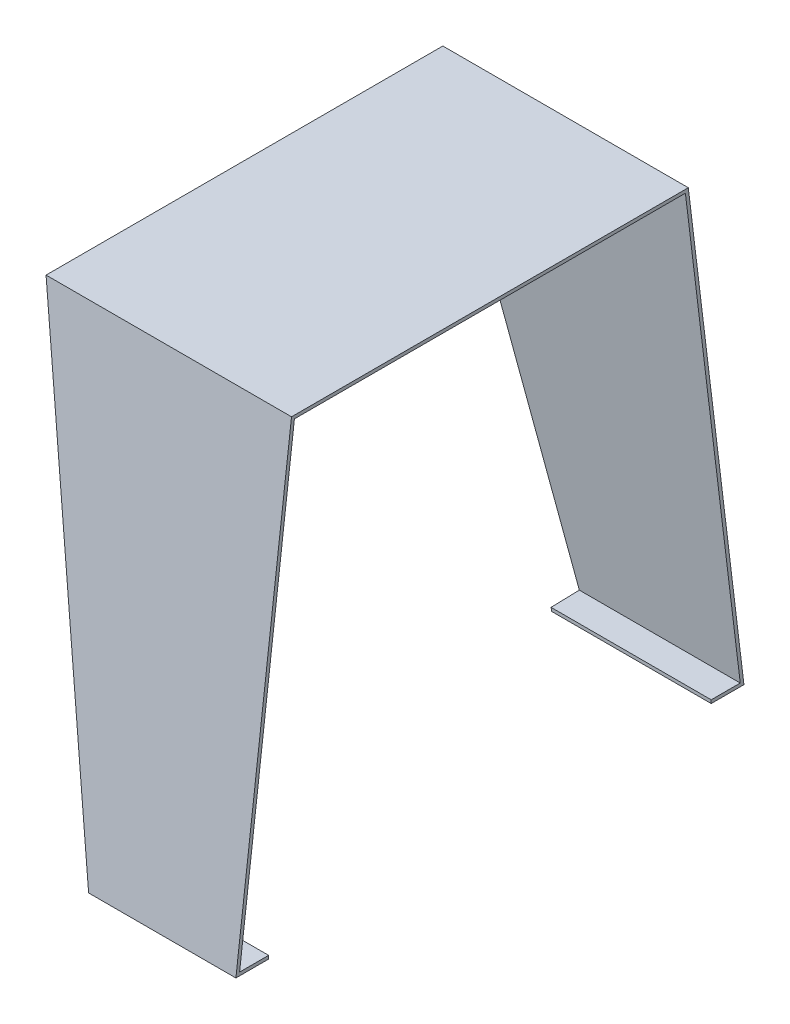
ISO-10303-21;
HEADER;
FILE_DESCRIPTION(('STEP AP214'),'2;1');
FILE_NAME('part.step','',(''),(''),'','','');
FILE_SCHEMA(('AUTOMOTIVE_DESIGN { 1 0 10303 214 1 1 1 1 }'));
ENDSEC;
DATA;
#1=APPLICATION_CONTEXT('core data for automotive mechanical design processes');
#2=APPLICATION_PROTOCOL_DEFINITION('international standard','automotive_design',2000,#1);
#3=PRODUCT_CONTEXT('',#1,'mechanical');
#4=PRODUCT('Part','Part','',(#3));
#5=PRODUCT_RELATED_PRODUCT_CATEGORY('part','',(#4));
#6=PRODUCT_DEFINITION_FORMATION('','',#4);
#7=PRODUCT_DEFINITION_CONTEXT('part definition',#1,'design');
#8=PRODUCT_DEFINITION('design','',#6,#7);
#9=PRODUCT_DEFINITION_SHAPE('','',#8);
#10=(LENGTH_UNIT() NAMED_UNIT(*) SI_UNIT(.MILLI.,.METRE.));
#11=(NAMED_UNIT(*) PLANE_ANGLE_UNIT() SI_UNIT($,.RADIAN.));
#12=(NAMED_UNIT(*) SI_UNIT($,.STERADIAN.) SOLID_ANGLE_UNIT());
#13=UNCERTAINTY_MEASURE_WITH_UNIT(LENGTH_MEASURE(1.E-05),#10,'distance_accuracy_value','');
#14=(GEOMETRIC_REPRESENTATION_CONTEXT(3) GLOBAL_UNCERTAINTY_ASSIGNED_CONTEXT((#13)) GLOBAL_UNIT_ASSIGNED_CONTEXT((#10,
#11,#12)) REPRESENTATION_CONTEXT('',''));
#15=CARTESIAN_POINT('',(0.,0.,0.));
#16=DIRECTION('',(0.,0.,1.));
#17=DIRECTION('',(1.,0.,0.));
#18=AXIS2_PLACEMENT_3D('',#15,#16,#17);
#19=CARTESIAN_POINT('',(150.,-280.,34.));
#20=DIRECTION('',(0.,1.,0.));
#21=DIRECTION('',(0.,0.,1.));
#22=AXIS2_PLACEMENT_3D('',#19,#20,#21);
#23=PLANE('',#22);
#24=DIRECTION('',(0.,0.,-1.));
#25=VECTOR('',#24,1.);
#26=CARTESIAN_POINT('',(150.,-280.,34.));
#27=LINE('',#26,#25);
#28=CARTESIAN_POINT('',(150.,-280.,-256.46));
#29=VERTEX_POINT('',#28);
#30=CARTESIAN_POINT('',(150.,-280.,-276.46));
#31=VERTEX_POINT('',#30);
#32=EDGE_CURVE('E183',#29,#31,#27,.T.);
#33=ORIENTED_EDGE('',*,*,#32,.F.);
#34=DIRECTION('',(1.,0.,0.));
#35=VECTOR('',#34,1.);
#36=CARTESIAN_POINT('',(0.,-280.,-256.46));
#37=LINE('',#36,#35);
#38=CARTESIAN_POINT('',(52.5519332294233,-280.,-256.46));
#39=VERTEX_POINT('',#38);
#40=EDGE_CURVE('E136',#39,#29,#37,.T.);
#41=ORIENTED_EDGE('',*,*,#40,.F.);
#42=DIRECTION('',(-0.0256338887285018,0.,-0.999671397884652));
#43=VECTOR('',#42,1.);
#44=CARTESIAN_POINT('',(60.0591386626211,-280.,36.3062918840597));
#45=LINE('',#44,#43);
#46=CARTESIAN_POINT('',(52.0390869324753,-280.,-276.46));
#47=VERTEX_POINT('',#46);
#48=EDGE_CURVE('E230',#39,#47,#45,.T.);
#49=ORIENTED_EDGE('',*,*,#48,.T.);
#50=DIRECTION('',(-1.,0.,0.));
#51=VECTOR('',#50,1.);
#52=CARTESIAN_POINT('',(150.,-280.,-276.46));
#53=LINE('',#52,#51);
#54=EDGE_CURVE('E193',#31,#47,#53,.T.);
#55=ORIENTED_EDGE('',*,*,#54,.F.);
#56=EDGE_LOOP('',(#33,#41,#49,#55));
#57=FACE_BOUND('',#56,.T.);
#58=ADVANCED_FACE('F32',(#57),#23,.F.);
#59=CARTESIAN_POINT('',(150.,-278.,31.742451915128));
#60=DIRECTION('',(0.,1.,0.));
#61=DIRECTION('',(0.,0.,1.));
#62=AXIS2_PLACEMENT_3D('',#59,#60,#61);
#63=PLANE('',#62);
#64=DIRECTION('',(-1.,0.,0.));
#65=VECTOR('',#64,1.);
#66=CARTESIAN_POINT('',(0.,-278.,-256.46));
#67=LINE('',#66,#65);
#68=CARTESIAN_POINT('',(150.,-278.,-256.46));
#69=VERTEX_POINT('',#68);
#70=CARTESIAN_POINT('',(52.129589220172,-278.,-256.46));
#71=VERTEX_POINT('',#70);
#72=EDGE_CURVE('E55',#69,#71,#67,.T.);
#73=ORIENTED_EDGE('',*,*,#72,.F.);
#74=DIRECTION('',(0.,0.,-1.));
#75=VECTOR('',#74,1.);
#76=CARTESIAN_POINT('',(150.,-278.,31.742451915128));
#77=LINE('',#76,#75);
#78=CARTESIAN_POINT('',(150.,-278.,-274.202451915128));
#79=VERTEX_POINT('',#78);
#80=EDGE_CURVE('E154',#69,#79,#77,.T.);
#81=ORIENTED_EDGE('',*,*,#80,.T.);
#82=DIRECTION('',(-1.,0.,0.));
#83=VECTOR('',#82,1.);
#84=CARTESIAN_POINT('',(150.,-278.,-274.202451915128));
#85=LINE('',#84,#83);
#86=CARTESIAN_POINT('',(51.6746316819994,-278.,-274.202451915128));
#87=VERTEX_POINT('',#86);
#88=EDGE_CURVE('E153',#79,#87,#85,.T.);
#89=ORIENTED_EDGE('',*,*,#88,.T.);
#90=DIRECTION('',(-0.0256338887285018,0.,-0.999671397884652));
#91=VECTOR('',#90,1.);
#92=CARTESIAN_POINT('',(59.5792214537459,-278.,34.0610499873584));
#93=LINE('',#92,#91);
#94=EDGE_CURVE('E40',#71,#87,#93,.T.);
#95=ORIENTED_EDGE('',*,*,#94,.F.);
#96=EDGE_LOOP('',(#73,#81,#89,#95));
#97=FACE_BOUND('',#96,.T.);
#98=ADVANCED_FACE('F220',(#97),#63,.T.);
#99=CARTESIAN_POINT('',(60.,-317.150927648449,-271.948815928403));
#100=DIRECTION('',(0.978114448495998,0.206550388842234,-0.0250811186451284));
#101=DIRECTION('',(-0.206615386062609,0.97842224128553,0.));
#102=AXIS2_PLACEMENT_3D('',#99,#100,#101);
#103=PLANE('',#102);
#104=ORIENTED_EDGE('',*,*,#48,.F.);
#105=DIRECTION('',(0.206615386062609,-0.97842224128553,0.));
#106=VECTOR('',#105,1.);
#107=CARTESIAN_POINT('',(50.3086976789349,-269.377211461033,-256.46));
#108=LINE('',#107,#106);
#109=EDGE_CURVE('E210',#71,#39,#108,.T.);
#110=ORIENTED_EDGE('',*,*,#109,.F.);
#111=ORIENTED_EDGE('',*,*,#94,.T.);
#112=DIRECTION('',(-0.20227182697728,0.972188237006813,0.118051428779399));
#113=VECTOR('',#112,1.);
#114=CARTESIAN_POINT('',(55.6975051811138,-297.335318977688,-276.550312076704));
#115=LINE('',#114,#113);
#116=CARTESIAN_POINT('',(0.,-29.6338789062195,-244.043708639455));
#117=VERTEX_POINT('',#116);
#118=EDGE_CURVE('E208',#87,#117,#115,.T.);
#119=ORIENTED_EDGE('',*,*,#118,.T.);
#120=DIRECTION('',(0.,0.120543125395831,0.99270809149508));
#121=VECTOR('',#120,1.);
#122=CARTESIAN_POINT('',(0.,-37.1509276484489,-305.948815928403));
#123=LINE('',#122,#121);
#124=CARTESIAN_POINT('',(0.,-29.8821811402827,-246.088550567034));
#125=VERTEX_POINT('',#124);
#126=EDGE_CURVE('E236',#125,#117,#123,.T.);
#127=ORIENTED_EDGE('',*,*,#126,.F.);
#128=DIRECTION('',(-0.20227182697728,0.972188237006813,0.118051428779398));
#129=VECTOR('',#128,1.);
#130=CARTESIAN_POINT('',(56.047049148837,-299.263650204496,-278.799157524832));
#131=LINE('',#130,#129);
#132=EDGE_CURVE('E217',#47,#125,#131,.T.);
#133=ORIENTED_EDGE('',*,*,#132,.F.);
#134=EDGE_LOOP('',(#104,#110,#111,#119,#127,#133));
#135=FACE_BOUND('',#134,.T.);
#136=ADVANCED_FACE('F207',(#135),#103,.F.);
#137=CARTESIAN_POINT('',(150.,0.,0.));
#138=DIRECTION('',(1.,0.,0.));
#139=DIRECTION('',(0.,0.,-1.));
#140=AXIS2_PLACEMENT_3D('',#137,#138,#139);
#141=PLANE('',#140);
#142=DIRECTION('',(0.,1.,0.));
#143=VECTOR('',#142,1.);
#144=CARTESIAN_POINT('',(150.,-280.001,-256.46));
#145=LINE('',#144,#143);
#146=EDGE_CURVE('E147',#29,#69,#145,.T.);
#147=ORIENTED_EDGE('',*,*,#146,.F.);
#148=ORIENTED_EDGE('',*,*,#32,.T.);
#149=DIRECTION('',(0.,0.992708091495081,0.120543125395831));
#150=VECTOR('',#149,1.);
#151=CARTESIAN_POINT('',(150.,-280.,-276.46));
#152=LINE('',#151,#150);
#153=CARTESIAN_POINT('',(150.,0.,-242.46));
#154=VERTEX_POINT('',#153);
#155=EDGE_CURVE('E185',#31,#154,#152,.T.);
#156=ORIENTED_EDGE('',*,*,#155,.T.);
#157=DIRECTION('',(0.,0.,1.));
#158=VECTOR('',#157,1.);
#159=CARTESIAN_POINT('',(150.,0.,-242.46));
#160=LINE('',#159,#158);
#161=CARTESIAN_POINT('',(150.,0.,0.));
#162=VERTEX_POINT('',#161);
#163=EDGE_CURVE('E177',#154,#162,#160,.T.);
#164=ORIENTED_EDGE('',*,*,#163,.T.);
#165=DIRECTION('',(0.,-0.99270809149508,0.120543125395831));
#166=VECTOR('',#165,1.);
#167=CARTESIAN_POINT('',(150.,0.,0.));
#168=LINE('',#167,#166);
#169=CARTESIAN_POINT('',(150.,-280.,34.));
#170=VERTEX_POINT('',#169);
#171=EDGE_CURVE('E180',#162,#170,#168,.T.);
#172=ORIENTED_EDGE('',*,*,#171,.T.);
#173=CARTESIAN_POINT('',(150.,-280.,14.));
#174=VERTEX_POINT('',#173);
#175=EDGE_CURVE('E146',#170,#174,#27,.T.);
#176=ORIENTED_EDGE('',*,*,#175,.T.);
#177=DIRECTION('',(0.,1.,0.));
#178=VECTOR('',#177,1.);
#179=CARTESIAN_POINT('',(150.,-280.001,14.));
#180=LINE('',#179,#178);
#181=CARTESIAN_POINT('',(150.,-278.,14.));
#182=VERTEX_POINT('',#181);
#183=EDGE_CURVE('E131',#174,#182,#180,.T.);
#184=ORIENTED_EDGE('',*,*,#183,.T.);
#185=CARTESIAN_POINT('',(150.,-278.,31.742451915128));
#186=VERTEX_POINT('',#185);
#187=EDGE_CURVE('E144',#186,#182,#77,.T.);
#188=ORIENTED_EDGE('',*,*,#187,.F.);
#189=DIRECTION('',(0.,-0.99270809149508,0.120543125395831));
#190=VECTOR('',#189,1.);
#191=CARTESIAN_POINT('',(150.,-2.,-1.77183379915767));
#192=LINE('',#191,#190);
#193=CARTESIAN_POINT('',(150.,-2.,-1.77183379915767));
#194=VERTEX_POINT('',#193);
#195=EDGE_CURVE('E158',#194,#186,#192,.T.);
#196=ORIENTED_EDGE('',*,*,#195,.F.);
#197=DIRECTION('',(0.,0.,1.));
#198=VECTOR('',#197,1.);
#199=CARTESIAN_POINT('',(150.,-2.,-240.688166200842));
#200=LINE('',#199,#198);
#201=CARTESIAN_POINT('',(150.,-2.,-240.688166200842));
#202=VERTEX_POINT('',#201);
#203=EDGE_CURVE('E224',#202,#194,#200,.T.);
#204=ORIENTED_EDGE('',*,*,#203,.F.);
#205=DIRECTION('',(0.,0.99270809149508,0.120543125395831));
#206=VECTOR('',#205,1.);
#207=CARTESIAN_POINT('',(150.,-278.,-274.202451915128));
#208=LINE('',#207,#206);
#209=EDGE_CURVE('E167',#79,#202,#208,.T.);
#210=ORIENTED_EDGE('',*,*,#209,.F.);
#211=ORIENTED_EDGE('',*,*,#80,.F.);
#212=EDGE_LOOP('',(#147,#148,#156,#164,#172,#176,#184,#188,#196,#204,#210,#211));
#213=FACE_BOUND('',#212,.T.);
#214=ADVANCED_FACE('F142',(#213),#141,.T.);
#215=CARTESIAN_POINT('',(0.,0.,0.));
#216=DIRECTION('',(1.,0.,0.));
#217=DIRECTION('',(0.,0.,-1.));
#218=AXIS2_PLACEMENT_3D('',#215,#216,#217);
#219=PLANE('',#218);
#220=DIRECTION('',(0.,0.992708091495081,0.120543125395831));
#221=VECTOR('',#220,1.);
#222=CARTESIAN_POINT('',(0.,-280.,-276.46));
#223=LINE('',#222,#221);
#224=CARTESIAN_POINT('',(0.,0.,-242.46));
#225=VERTEX_POINT('',#224);
#226=EDGE_CURVE('E181',#125,#225,#223,.T.);
#227=ORIENTED_EDGE('',*,*,#226,.F.);
#228=ORIENTED_EDGE('',*,*,#126,.T.);
#229=DIRECTION('',(0.,0.99270809149508,0.120543125395831));
#230=VECTOR('',#229,1.);
#231=CARTESIAN_POINT('',(0.,-278.,-274.202451915128));
#232=LINE('',#231,#230);
#233=CARTESIAN_POINT('',(0.,-2.,-240.688166200842));
#234=VERTEX_POINT('',#233);
#235=EDGE_CURVE('E162',#117,#234,#232,.T.);
#236=ORIENTED_EDGE('',*,*,#235,.T.);
#237=DIRECTION('',(0.,0.,1.));
#238=VECTOR('',#237,1.);
#239=CARTESIAN_POINT('',(0.,-2.,-240.688166200842));
#240=LINE('',#239,#238);
#241=CARTESIAN_POINT('',(0.,-2.00000000000002,-16.4705882352945));
#242=VERTEX_POINT('',#241);
#243=EDGE_CURVE('E164',#234,#242,#240,.T.);
#244=ORIENTED_EDGE('',*,*,#243,.T.);
#245=CARTESIAN_POINT('',(0.,0.,0.));
#246=VERTEX_POINT('',#245);
#247=EDGE_CURVE('E237',#242,#246,#123,.T.);
#248=ORIENTED_EDGE('',*,*,#247,.T.);
#249=DIRECTION('',(0.,0.,1.));
#250=VECTOR('',#249,1.);
#251=CARTESIAN_POINT('',(0.,0.,-242.46));
#252=LINE('',#251,#250);
#253=EDGE_CURVE('E176',#225,#246,#252,.T.);
#254=ORIENTED_EDGE('',*,*,#253,.F.);
#255=EDGE_LOOP('',(#227,#228,#236,#244,#248,#254));
#256=FACE_BOUND('',#255,.T.);
#257=ADVANCED_FACE('F262',(#256),#219,.F.);
#258=CARTESIAN_POINT('',(150.,0.,-242.46));
#259=DIRECTION('',(0.,-1.,0.));
#260=DIRECTION('',(0.,0.,-1.));
#261=AXIS2_PLACEMENT_3D('',#258,#259,#260);
#262=PLANE('',#261);
#263=ORIENTED_EDGE('',*,*,#253,.T.);
#264=DIRECTION('',(-1.,0.,0.));
#265=VECTOR('',#264,1.);
#266=CARTESIAN_POINT('',(150.,0.,0.));
#267=LINE('',#266,#265);
#268=EDGE_CURVE('E198',#162,#246,#267,.T.);
#269=ORIENTED_EDGE('',*,*,#268,.F.);
#270=ORIENTED_EDGE('',*,*,#163,.F.);
#271=DIRECTION('',(-1.,0.,0.));
#272=VECTOR('',#271,1.);
#273=CARTESIAN_POINT('',(150.,0.,-242.46));
#274=LINE('',#273,#272);
#275=EDGE_CURVE('E187',#154,#225,#274,.T.);
#276=ORIENTED_EDGE('',*,*,#275,.T.);
#277=EDGE_LOOP('',(#263,#269,#270,#276));
#278=FACE_BOUND('',#277,.T.);
#279=ADVANCED_FACE('F34',(#278),#262,.F.);
#280=CARTESIAN_POINT('',(150.,0.,0.));
#281=DIRECTION('',(0.,-0.120543125395831,-0.99270809149508));
#282=DIRECTION('',(0.,0.992708091495081,-0.120543125395831));
#283=AXIS2_PLACEMENT_3D('',#280,#281,#282);
#284=PLANE('',#283);
#285=ORIENTED_EDGE('',*,*,#268,.T.);
#286=DIRECTION('',(-0.208067598735048,0.970982127430226,-0.117904972616527));
#287=VECTOR('',#286,1.);
#288=CARTESIAN_POINT('',(60.,-280.,34.));
#289=LINE('',#288,#287);
#290=CARTESIAN_POINT('',(60.,-280.,34.));
#291=VERTEX_POINT('',#290);
#292=EDGE_CURVE('E240',#291,#246,#289,.T.);
#293=ORIENTED_EDGE('',*,*,#292,.F.);
#294=DIRECTION('',(-1.,0.,0.));
#295=VECTOR('',#294,1.);
#296=CARTESIAN_POINT('',(150.,-280.,34.));
#297=LINE('',#296,#295);
#298=EDGE_CURVE('E196',#170,#291,#297,.T.);
#299=ORIENTED_EDGE('',*,*,#298,.F.);
#300=ORIENTED_EDGE('',*,*,#171,.F.);
#301=EDGE_LOOP('',(#285,#293,#299,#300));
#302=FACE_BOUND('',#301,.T.);
#303=ADVANCED_FACE('F275',(#302),#284,.F.);
#304=CARTESIAN_POINT('',(59.4871537030519,-280.,14.));
#305=VERTEX_POINT('',#304);
#306=EDGE_CURVE('E165',#291,#305,#45,.T.);
#307=ORIENTED_EDGE('',*,*,#306,.T.);
#308=DIRECTION('',(-1.,0.,0.));
#309=VECTOR('',#308,1.);
#310=CARTESIAN_POINT('',(0.,-280.,14.));
#311=LINE('',#310,#309);
#312=EDGE_CURVE('E47',#174,#305,#311,.T.);
#313=ORIENTED_EDGE('',*,*,#312,.F.);
#314=ORIENTED_EDGE('',*,*,#175,.F.);
#315=ORIENTED_EDGE('',*,*,#298,.T.);
#316=EDGE_LOOP('',(#307,#313,#314,#315));
#317=FACE_BOUND('',#316,.T.);
#318=ADVANCED_FACE('F274',(#317),#23,.F.);
#319=CARTESIAN_POINT('',(150.,-280.,-276.46));
#320=DIRECTION('',(0.,-0.120543125395831,0.99270809149508));
#321=DIRECTION('',(0.,-0.99270809149508,-0.120543125395831));
#322=AXIS2_PLACEMENT_3D('',#319,#320,#321);
#323=PLANE('',#322);
#324=ORIENTED_EDGE('',*,*,#54,.T.);
#325=ORIENTED_EDGE('',*,*,#132,.T.);
#326=ORIENTED_EDGE('',*,*,#226,.T.);
#327=ORIENTED_EDGE('',*,*,#275,.F.);
#328=ORIENTED_EDGE('',*,*,#155,.F.);
#329=EDGE_LOOP('',(#324,#325,#326,#327,#328));
#330=FACE_BOUND('',#329,.T.);
#331=ADVANCED_FACE('F255',(#330),#323,.F.);
#332=CARTESIAN_POINT('',(150.,-278.,-274.202451915128));
#333=DIRECTION('',(0.,-0.120543125395831,0.99270809149508));
#334=DIRECTION('',(0.,-0.992708091495081,-0.120543125395831));
#335=AXIS2_PLACEMENT_3D('',#332,#333,#334);
#336=PLANE('',#335);
#337=ORIENTED_EDGE('',*,*,#118,.F.);
#338=ORIENTED_EDGE('',*,*,#88,.F.);
#339=ORIENTED_EDGE('',*,*,#209,.T.);
#340=DIRECTION('',(-1.,0.,0.));
#341=VECTOR('',#340,1.);
#342=CARTESIAN_POINT('',(150.,-2.,-240.688166200842));
#343=LINE('',#342,#341);
#344=EDGE_CURVE('E173',#202,#234,#343,.T.);
#345=ORIENTED_EDGE('',*,*,#344,.T.);
#346=ORIENTED_EDGE('',*,*,#235,.F.);
#347=EDGE_LOOP('',(#337,#338,#339,#345,#346));
#348=FACE_BOUND('',#347,.T.);
#349=ADVANCED_FACE('F215',(#348),#336,.T.);
#350=CARTESIAN_POINT('',(150.,-2.,-240.688166200842));
#351=DIRECTION('',(0.,-1.,0.));
#352=DIRECTION('',(0.,0.,-1.));
#353=AXIS2_PLACEMENT_3D('',#350,#351,#352);
#354=PLANE('',#353);
#355=DIRECTION('',(0.0256338887285018,0.,0.999671397884652));
#356=VECTOR('',#355,1.);
#357=CARTESIAN_POINT('',(-5.64711534369228,-2.,-236.697013864109));
#358=LINE('',#357,#356);
#359=CARTESIAN_POINT('',(0.376910089116089,-2.,-1.77183379915767));
#360=VERTEX_POINT('',#359);
#361=EDGE_CURVE('E218',#242,#360,#358,.T.);
#362=ORIENTED_EDGE('',*,*,#361,.F.);
#363=ORIENTED_EDGE('',*,*,#243,.F.);
#364=ORIENTED_EDGE('',*,*,#344,.F.);
#365=ORIENTED_EDGE('',*,*,#203,.T.);
#366=DIRECTION('',(-1.,0.,0.));
#367=VECTOR('',#366,1.);
#368=CARTESIAN_POINT('',(150.,-2.,-1.77183379915767));
#369=LINE('',#368,#367);
#370=EDGE_CURVE('E170',#194,#360,#369,.T.);
#371=ORIENTED_EDGE('',*,*,#370,.T.);
#372=EDGE_LOOP('',(#362,#363,#364,#365,#371));
#373=FACE_BOUND('',#372,.T.);
#374=ADVANCED_FACE('F269',(#373),#354,.T.);
#375=CARTESIAN_POINT('',(150.,-2.,-1.77183379915767));
#376=DIRECTION('',(0.,-0.120543125395831,-0.99270809149508));
#377=DIRECTION('',(0.,0.992708091495081,-0.120543125395831));
#378=AXIS2_PLACEMENT_3D('',#375,#376,#377);
#379=PLANE('',#378);
#380=DIRECTION('',(0.208067598735048,-0.970982127430226,0.117904972616527));
#381=VECTOR('',#380,1.);
#382=CARTESIAN_POINT('',(6.85441169668719,-32.2283408353318,1.89875044513261));
#383=LINE('',#382,#381);
#384=CARTESIAN_POINT('',(59.5197672319732,-278.,31.742451915128));
#385=VERTEX_POINT('',#384);
#386=EDGE_CURVE('E234',#360,#385,#383,.T.);
#387=ORIENTED_EDGE('',*,*,#386,.F.);
#388=ORIENTED_EDGE('',*,*,#370,.F.);
#389=ORIENTED_EDGE('',*,*,#195,.T.);
#390=DIRECTION('',(-1.,0.,0.));
#391=VECTOR('',#390,1.);
#392=CARTESIAN_POINT('',(150.,-278.,31.742451915128));
#393=LINE('',#392,#391);
#394=EDGE_CURVE('E151',#186,#385,#393,.T.);
#395=ORIENTED_EDGE('',*,*,#394,.T.);
#396=EDGE_LOOP('',(#387,#388,#389,#395));
#397=FACE_BOUND('',#396,.T.);
#398=ADVANCED_FACE('F272',(#397),#379,.T.);
#399=DIRECTION('',(1.,0.,0.));
#400=VECTOR('',#399,1.);
#401=CARTESIAN_POINT('',(0.,-278.,14.));
#402=LINE('',#401,#400);
#403=CARTESIAN_POINT('',(59.0648096938006,-278.,14.));
#404=VERTEX_POINT('',#403);
#405=EDGE_CURVE('E128',#404,#182,#402,.T.);
#406=ORIENTED_EDGE('',*,*,#405,.F.);
#407=EDGE_CURVE('E11',#385,#404,#93,.T.);
#408=ORIENTED_EDGE('',*,*,#407,.F.);
#409=ORIENTED_EDGE('',*,*,#394,.F.);
#410=ORIENTED_EDGE('',*,*,#187,.T.);
#411=EDGE_LOOP('',(#406,#408,#409,#410));
#412=FACE_BOUND('',#411,.T.);
#413=ADVANCED_FACE('F149',(#412),#63,.T.);
#414=ORIENTED_EDGE('',*,*,#407,.T.);
#415=DIRECTION('',(-0.206615386062609,0.97842224128553,0.));
#416=VECTOR('',#415,1.);
#417=CARTESIAN_POINT('',(56.9478541609121,-267.97520747771,14.));
#418=LINE('',#417,#416);
#419=EDGE_CURVE('E132',#305,#404,#418,.T.);
#420=ORIENTED_EDGE('',*,*,#419,.F.);
#421=ORIENTED_EDGE('',*,*,#306,.F.);
#422=ORIENTED_EDGE('',*,*,#292,.T.);
#423=ORIENTED_EDGE('',*,*,#247,.F.);
#424=ORIENTED_EDGE('',*,*,#361,.T.);
#425=ORIENTED_EDGE('',*,*,#386,.T.);
#426=EDGE_LOOP('',(#414,#420,#421,#422,#423,#424,#425));
#427=FACE_BOUND('',#426,.T.);
#428=ADVANCED_FACE('F266',(#427),#103,.F.);
#429=CARTESIAN_POINT('',(0.,-280.001,14.));
#430=DIRECTION('',(0.,0.,1.));
#431=DIRECTION('',(1.,0.,0.));
#432=AXIS2_PLACEMENT_3D('',#429,#430,#431);
#433=PLANE('',#432);
#434=ORIENTED_EDGE('',*,*,#312,.T.);
#435=ORIENTED_EDGE('',*,*,#419,.T.);
#436=ORIENTED_EDGE('',*,*,#405,.T.);
#437=ORIENTED_EDGE('',*,*,#183,.F.);
#438=EDGE_LOOP('',(#434,#435,#436,#437));
#439=FACE_BOUND('',#438,.T.);
#440=ADVANCED_FACE('F130',(#439),#433,.F.);
#441=CARTESIAN_POINT('',(0.,-280.001,-256.46));
#442=DIRECTION('',(0.,0.,-1.));
#443=DIRECTION('',(-1.,0.,0.));
#444=AXIS2_PLACEMENT_3D('',#441,#442,#443);
#445=PLANE('',#444);
#446=ORIENTED_EDGE('',*,*,#40,.T.);
#447=ORIENTED_EDGE('',*,*,#146,.T.);
#448=ORIENTED_EDGE('',*,*,#72,.T.);
#449=ORIENTED_EDGE('',*,*,#109,.T.);
#450=EDGE_LOOP('',(#446,#447,#448,#449));
#451=FACE_BOUND('',#450,.T.);
#452=ADVANCED_FACE('F248',(#451),#445,.F.);
#453=CLOSED_SHELL('',(#58,#98,#136,#214,#257,#279,#303,#318,#331,#349,#374,#398,#413,#428,#440,#452));
#454=MANIFOLD_SOLID_BREP('B2',#453);
#455=ADVANCED_BREP_SHAPE_REPRESENTATION('',(#18,#454),#14);
#456=SHAPE_DEFINITION_REPRESENTATION(#9,#455);
ENDSEC;
END-ISO-10303-21;
